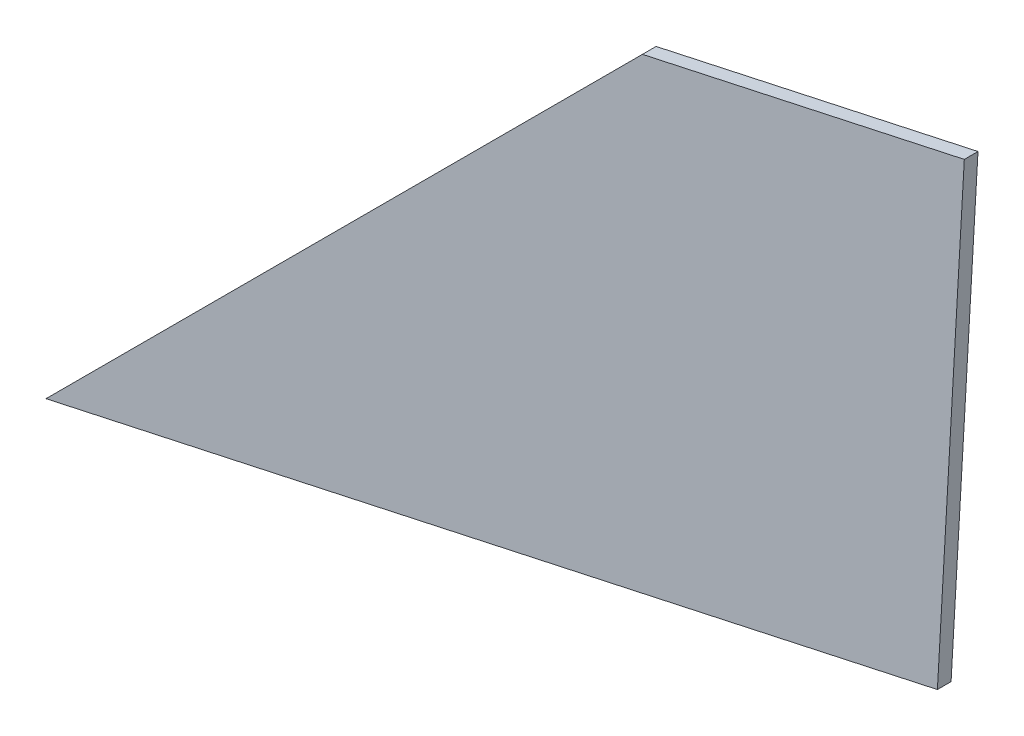
ISO-10303-21;
HEADER;
FILE_DESCRIPTION(('STEP AP214'),'2;1');
FILE_NAME('part.step','',(''),(''),'','','');
FILE_SCHEMA(('AUTOMOTIVE_DESIGN { 1 0 10303 214 1 1 1 1 }'));
ENDSEC;
DATA;
#1=APPLICATION_CONTEXT('core data for automotive mechanical design processes');
#2=APPLICATION_PROTOCOL_DEFINITION('international standard','automotive_design',2000,#1);
#3=PRODUCT_CONTEXT('',#1,'mechanical');
#4=PRODUCT('Part','Part','',(#3));
#5=PRODUCT_RELATED_PRODUCT_CATEGORY('part','',(#4));
#6=PRODUCT_DEFINITION_FORMATION('','',#4);
#7=PRODUCT_DEFINITION_CONTEXT('part definition',#1,'design');
#8=PRODUCT_DEFINITION('design','',#6,#7);
#9=PRODUCT_DEFINITION_SHAPE('','',#8);
#10=(LENGTH_UNIT() NAMED_UNIT(*) SI_UNIT(.MILLI.,.METRE.));
#11=(NAMED_UNIT(*) PLANE_ANGLE_UNIT() SI_UNIT($,.RADIAN.));
#12=(NAMED_UNIT(*) SI_UNIT($,.STERADIAN.) SOLID_ANGLE_UNIT());
#13=UNCERTAINTY_MEASURE_WITH_UNIT(LENGTH_MEASURE(1.E-05),#10,'distance_accuracy_value','');
#14=(GEOMETRIC_REPRESENTATION_CONTEXT(3) GLOBAL_UNCERTAINTY_ASSIGNED_CONTEXT((#13)) GLOBAL_UNIT_ASSIGNED_CONTEXT((#10,
#11,#12)) REPRESENTATION_CONTEXT('',''));
#15=CARTESIAN_POINT('',(0.,0.,0.));
#16=DIRECTION('',(0.,0.,1.));
#17=DIRECTION('',(1.,0.,0.));
#18=AXIS2_PLACEMENT_3D('',#15,#16,#17);
#19=CARTESIAN_POINT('',(117.686022959398,117.686022959399,2.7));
#20=DIRECTION('',(0.707106781186551,-0.707106781186544,0.));
#21=DIRECTION('',(0.707106781186544,0.707106781186551,0.));
#22=AXIS2_PLACEMENT_3D('',#19,#20,#21);
#23=PLANE('',#22);
#24=DIRECTION('',(-0.707106781186544,-0.707106781186551,0.));
#25=VECTOR('',#24,1.);
#26=CARTESIAN_POINT('',(117.686022959398,117.686022959399,0.));
#27=LINE('',#26,#25);
#28=CARTESIAN_POINT('',(117.686022959398,117.686022959399,0.));
#29=VERTEX_POINT('',#28);
#30=CARTESIAN_POINT('',(0.,0.,0.));
#31=VERTEX_POINT('',#30);
#32=EDGE_CURVE('E115',#29,#31,#27,.T.);
#33=ORIENTED_EDGE('',*,*,#32,.T.);
#34=DIRECTION('',(0.,0.,-1.));
#35=VECTOR('',#34,1.);
#36=CARTESIAN_POINT('',(0.,0.,2.7));
#37=LINE('',#36,#35);
#38=CARTESIAN_POINT('',(0.,0.,2.7));
#39=VERTEX_POINT('',#38);
#40=EDGE_CURVE('E12',#39,#31,#37,.T.);
#41=ORIENTED_EDGE('',*,*,#40,.F.);
#42=DIRECTION('',(-0.707106781186544,-0.707106781186551,0.));
#43=VECTOR('',#42,1.);
#44=CARTESIAN_POINT('',(117.686022959398,117.686022959399,2.7));
#45=LINE('',#44,#43);
#46=CARTESIAN_POINT('',(117.686022959398,117.686022959399,2.7));
#47=VERTEX_POINT('',#46);
#48=EDGE_CURVE('E99',#47,#39,#45,.T.);
#49=ORIENTED_EDGE('',*,*,#48,.F.);
#50=DIRECTION('',(0.,0.,-1.));
#51=VECTOR('',#50,1.);
#52=CARTESIAN_POINT('',(117.686022959398,117.686022959399,2.7));
#53=LINE('',#52,#51);
#54=EDGE_CURVE('E111',#47,#29,#53,.T.);
#55=ORIENTED_EDGE('',*,*,#54,.T.);
#56=EDGE_LOOP('',(#33,#41,#49,#55));
#57=FACE_BOUND('',#56,.T.);
#58=ADVANCED_FACE('F46',(#57),#23,.F.);
#59=CARTESIAN_POINT('',(0.,0.,2.7));
#60=DIRECTION('',(-0.212429644331049,0.9771763639228,0.));
#61=DIRECTION('',(-0.9771763639228,-0.212429644331049,0.));
#62=AXIS2_PLACEMENT_3D('',#59,#60,#61);
#63=PLANE('',#62);
#64=DIRECTION('',(0.9771763639228,0.212429644331049,0.));
#65=VECTOR('',#64,1.);
#66=CARTESIAN_POINT('',(0.,0.,0.));
#67=LINE('',#66,#65);
#68=CARTESIAN_POINT('',(175.891745506104,38.2373359795888,0.));
#69=VERTEX_POINT('',#68);
#70=EDGE_CURVE('E104',#31,#69,#67,.T.);
#71=ORIENTED_EDGE('',*,*,#70,.T.);
#72=DIRECTION('',(0.,0.,-1.));
#73=VECTOR('',#72,1.);
#74=CARTESIAN_POINT('',(175.891745506104,38.2373359795888,2.7));
#75=LINE('',#74,#73);
#76=CARTESIAN_POINT('',(175.891745506104,38.2373359795888,2.7));
#77=VERTEX_POINT('',#76);
#78=EDGE_CURVE('E56',#77,#69,#75,.T.);
#79=ORIENTED_EDGE('',*,*,#78,.F.);
#80=DIRECTION('',(0.9771763639228,0.212429644331049,0.));
#81=VECTOR('',#80,1.);
#82=CARTESIAN_POINT('',(0.,0.,2.7));
#83=LINE('',#82,#81);
#84=EDGE_CURVE('E94',#39,#77,#83,.T.);
#85=ORIENTED_EDGE('',*,*,#84,.F.);
#86=ORIENTED_EDGE('',*,*,#40,.T.);
#87=EDGE_LOOP('',(#71,#79,#85,#86));
#88=FACE_BOUND('',#87,.T.);
#89=ADVANCED_FACE('F103',(#88),#63,.F.);
#90=CARTESIAN_POINT('',(175.891745506104,38.2373359795888,2.7));
#91=DIRECTION('',(-0.99838241829815,0.0568554907914613,0.));
#92=DIRECTION('',(-0.0568554907914613,-0.99838241829815,0.));
#93=AXIS2_PLACEMENT_3D('',#90,#91,#92);
#94=PLANE('',#93);
#95=DIRECTION('',(0.0568554907914613,0.99838241829815,0.));
#96=VECTOR('',#95,1.);
#97=CARTESIAN_POINT('',(175.891745506104,38.2373359795888,0.));
#98=LINE('',#97,#96);
#99=CARTESIAN_POINT('',(181.20248661438,131.493949840917,0.));
#100=VERTEX_POINT('',#99);
#101=EDGE_CURVE('E81',#69,#100,#98,.T.);
#102=ORIENTED_EDGE('',*,*,#101,.T.);
#103=DIRECTION('',(0.,0.,-1.));
#104=VECTOR('',#103,1.);
#105=CARTESIAN_POINT('',(181.20248661438,131.493949840917,2.7));
#106=LINE('',#105,#104);
#107=CARTESIAN_POINT('',(181.20248661438,131.493949840917,2.7));
#108=VERTEX_POINT('',#107);
#109=EDGE_CURVE('E106',#108,#100,#106,.T.);
#110=ORIENTED_EDGE('',*,*,#109,.F.);
#111=DIRECTION('',(0.0568554907914613,0.99838241829815,0.));
#112=VECTOR('',#111,1.);
#113=CARTESIAN_POINT('',(175.891745506104,38.2373359795888,2.7));
#114=LINE('',#113,#112);
#115=EDGE_CURVE('E97',#77,#108,#114,.T.);
#116=ORIENTED_EDGE('',*,*,#115,.F.);
#117=ORIENTED_EDGE('',*,*,#78,.T.);
#118=EDGE_LOOP('',(#102,#110,#116,#117));
#119=FACE_BOUND('',#118,.T.);
#120=ADVANCED_FACE('F107',(#119),#94,.F.);
#121=CARTESIAN_POINT('',(181.20248661438,131.493949840917,2.7));
#122=DIRECTION('',(0.212429644331049,-0.9771763639228,0.));
#123=DIRECTION('',(0.9771763639228,0.212429644331049,0.));
#124=AXIS2_PLACEMENT_3D('',#121,#122,#123);
#125=PLANE('',#124);
#126=DIRECTION('',(-0.9771763639228,-0.212429644331049,0.));
#127=VECTOR('',#126,1.);
#128=CARTESIAN_POINT('',(181.20248661438,131.493949840917,0.));
#129=LINE('',#128,#127);
#130=EDGE_CURVE('E87',#100,#29,#129,.T.);
#131=ORIENTED_EDGE('',*,*,#130,.T.);
#132=ORIENTED_EDGE('',*,*,#54,.F.);
#133=DIRECTION('',(-0.9771763639228,-0.212429644331049,0.));
#134=VECTOR('',#133,1.);
#135=CARTESIAN_POINT('',(181.20248661438,131.493949840917,2.7));
#136=LINE('',#135,#134);
#137=EDGE_CURVE('E64',#108,#47,#136,.T.);
#138=ORIENTED_EDGE('',*,*,#137,.F.);
#139=ORIENTED_EDGE('',*,*,#109,.T.);
#140=EDGE_LOOP('',(#131,#132,#138,#139));
#141=FACE_BOUND('',#140,.T.);
#142=ADVANCED_FACE('F136',(#141),#125,.F.);
#143=CARTESIAN_POINT('',(0.,0.,2.7));
#144=DIRECTION('',(0.,0.,-1.));
#145=DIRECTION('',(-1.,0.,0.));
#146=AXIS2_PLACEMENT_3D('',#143,#144,#145);
#147=PLANE('',#146);
#148=ORIENTED_EDGE('',*,*,#48,.T.);
#149=ORIENTED_EDGE('',*,*,#84,.T.);
#150=ORIENTED_EDGE('',*,*,#115,.T.);
#151=ORIENTED_EDGE('',*,*,#137,.T.);
#152=EDGE_LOOP('',(#148,#149,#150,#151));
#153=FACE_BOUND('',#152,.T.);
#154=ADVANCED_FACE('F95',(#153),#147,.F.);
#155=CARTESIAN_POINT('',(0.,0.,0.));
#156=DIRECTION('',(0.,0.,-1.));
#157=DIRECTION('',(-1.,0.,0.));
#158=AXIS2_PLACEMENT_3D('',#155,#156,#157);
#159=PLANE('',#158);
#160=ORIENTED_EDGE('',*,*,#32,.F.);
#161=ORIENTED_EDGE('',*,*,#130,.F.);
#162=ORIENTED_EDGE('',*,*,#101,.F.);
#163=ORIENTED_EDGE('',*,*,#70,.F.);
#164=EDGE_LOOP('',(#160,#161,#162,#163));
#165=FACE_BOUND('',#164,.T.);
#166=ADVANCED_FACE('F139',(#165),#159,.T.);
#167=CLOSED_SHELL('',(#58,#89,#120,#142,#154,#166));
#168=MANIFOLD_SOLID_BREP('B2',#167);
#169=ADVANCED_BREP_SHAPE_REPRESENTATION('',(#18,#168),#14);
#170=SHAPE_DEFINITION_REPRESENTATION(#9,#169);
ENDSEC;
END-ISO-10303-21;
